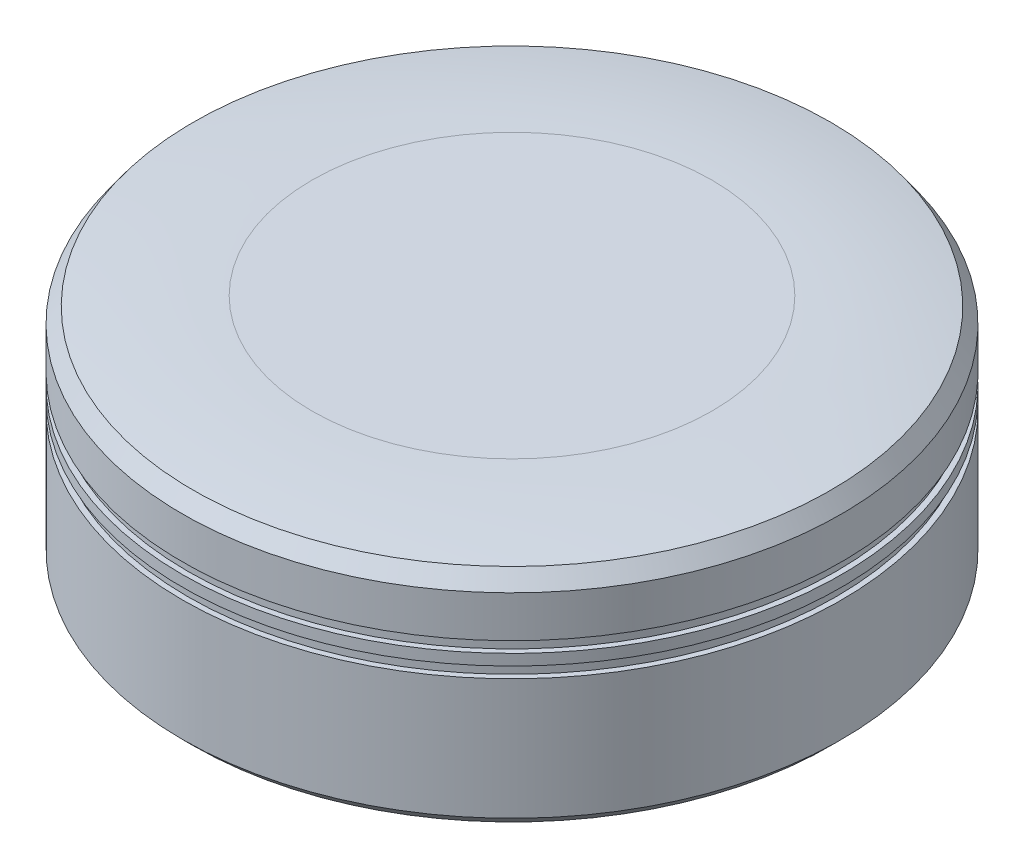
ISO-10303-21;
HEADER;
FILE_DESCRIPTION(('STEP AP214'),'2;1');
FILE_NAME('part.step','',(''),(''),'','','');
FILE_SCHEMA(('AUTOMOTIVE_DESIGN { 1 0 10303 214 1 1 1 1 }'));
ENDSEC;
DATA;
#1=APPLICATION_CONTEXT('core data for automotive mechanical design processes');
#2=APPLICATION_PROTOCOL_DEFINITION('international standard','automotive_design',2000,#1);
#3=PRODUCT_CONTEXT('',#1,'mechanical');
#4=PRODUCT('Part','Part','',(#3));
#5=PRODUCT_RELATED_PRODUCT_CATEGORY('part','',(#4));
#6=PRODUCT_DEFINITION_FORMATION('','',#4);
#7=PRODUCT_DEFINITION_CONTEXT('part definition',#1,'design');
#8=PRODUCT_DEFINITION('design','',#6,#7);
#9=PRODUCT_DEFINITION_SHAPE('','',#8);
#10=(LENGTH_UNIT() NAMED_UNIT(*) SI_UNIT(.MILLI.,.METRE.));
#11=(NAMED_UNIT(*) PLANE_ANGLE_UNIT() SI_UNIT($,.RADIAN.));
#12=(NAMED_UNIT(*) SI_UNIT($,.STERADIAN.) SOLID_ANGLE_UNIT());
#13=UNCERTAINTY_MEASURE_WITH_UNIT(LENGTH_MEASURE(1.E-05),#10,'distance_accuracy_value','');
#14=(GEOMETRIC_REPRESENTATION_CONTEXT(3) GLOBAL_UNCERTAINTY_ASSIGNED_CONTEXT((#13)) GLOBAL_UNIT_ASSIGNED_CONTEXT((#10,
#11,#12)) REPRESENTATION_CONTEXT('',''));
#15=CARTESIAN_POINT('',(0.,0.,0.));
#16=DIRECTION('',(0.,0.,1.));
#17=DIRECTION('',(1.,0.,0.));
#18=AXIS2_PLACEMENT_3D('',#15,#16,#17);
#19=CARTESIAN_POINT('',(0.,12.,0.));
#20=DIRECTION('',(0.,-1.,0.));
#21=DIRECTION('',(0.,0.,-1.));
#22=AXIS2_PLACEMENT_3D('',#19,#20,#21);
#23=CYLINDRICAL_SURFACE('',#22,15.);
#24=CARTESIAN_POINT('',(0.,8.5,0.));
#25=DIRECTION('',(0.,1.,0.));
#26=DIRECTION('',(0.,0.,1.));
#27=AXIS2_PLACEMENT_3D('',#24,#25,#26);
#28=CIRCLE('',#27,15.);
#29=CARTESIAN_POINT('',(0.,8.5,15.));
#30=VERTEX_POINT('',#29);
#31=EDGE_CURVE('E70',#30,#30,#28,.T.);
#32=ORIENTED_EDGE('',*,*,#31,.F.);
#33=EDGE_LOOP('',(#32));
#34=FACE_BOUND('',#33,.T.);
#35=CARTESIAN_POINT('',(0.,8.,0.));
#36=DIRECTION('',(0.,-1.,0.));
#37=DIRECTION('',(0.,0.,-1.));
#38=AXIS2_PLACEMENT_3D('',#35,#36,#37);
#39=CIRCLE('',#38,15.);
#40=CARTESIAN_POINT('',(0.,8.,-15.));
#41=VERTEX_POINT('',#40);
#42=EDGE_CURVE('E59',#41,#41,#39,.T.);
#43=ORIENTED_EDGE('',*,*,#42,.F.);
#44=EDGE_LOOP('',(#43));
#45=FACE_BOUND('',#44,.T.);
#46=ADVANCED_FACE('F35',(#34,#45),#23,.T.);
#47=CARTESIAN_POINT('',(14.75,9.,0.));
#48=DIRECTION('',(0.,-1.,0.));
#49=DIRECTION('',(0.,0.,-1.));
#50=AXIS2_PLACEMENT_3D('',#47,#48,#49);
#51=PLANE('',#50);
#52=CARTESIAN_POINT('',(0.,9.,0.));
#53=DIRECTION('',(0.,1.,0.));
#54=DIRECTION('',(0.,0.,1.));
#55=AXIS2_PLACEMENT_3D('',#52,#53,#54);
#56=CIRCLE('',#55,14.75);
#57=CARTESIAN_POINT('',(0.,9.,14.75));
#58=VERTEX_POINT('',#57);
#59=EDGE_CURVE('E73',#58,#58,#56,.T.);
#60=ORIENTED_EDGE('',*,*,#59,.T.);
#61=EDGE_LOOP('',(#60));
#62=FACE_BOUND('',#61,.T.);
#63=CARTESIAN_POINT('',(0.,9.,0.));
#64=DIRECTION('',(0.,-1.,0.));
#65=DIRECTION('',(0.,0.,-1.));
#66=AXIS2_PLACEMENT_3D('',#63,#64,#65);
#67=CIRCLE('',#66,15.);
#68=CARTESIAN_POINT('',(0.,9.,-15.));
#69=VERTEX_POINT('',#68);
#70=EDGE_CURVE('E67',#69,#69,#67,.T.);
#71=ORIENTED_EDGE('',*,*,#70,.T.);
#72=EDGE_LOOP('',(#71));
#73=FACE_BOUND('',#72,.T.);
#74=ADVANCED_FACE('F107',(#62,#73),#51,.T.);
#75=CARTESIAN_POINT('',(15.3281983976125,8.5,0.));
#76=DIRECTION('',(0.,1.,0.));
#77=DIRECTION('',(0.,0.,1.));
#78=AXIS2_PLACEMENT_3D('',#75,#76,#77);
#79=PLANE('',#78);
#80=CARTESIAN_POINT('',(0.,8.5,0.));
#81=DIRECTION('',(0.,1.,0.));
#82=DIRECTION('',(0.,0.,1.));
#83=AXIS2_PLACEMENT_3D('',#80,#81,#82);
#84=CIRCLE('',#83,14.75);
#85=CARTESIAN_POINT('',(0.,8.5,14.75));
#86=VERTEX_POINT('',#85);
#87=EDGE_CURVE('E62',#86,#86,#84,.T.);
#88=ORIENTED_EDGE('',*,*,#87,.F.);
#89=EDGE_LOOP('',(#88));
#90=FACE_BOUND('',#89,.T.);
#91=ORIENTED_EDGE('',*,*,#31,.T.);
#92=EDGE_LOOP('',(#91));
#93=FACE_BOUND('',#92,.T.);
#94=ADVANCED_FACE('F115',(#90,#93),#79,.T.);
#95=CARTESIAN_POINT('',(0.,13.0008010501509,0.));
#96=DIRECTION('',(0.,1.,0.));
#97=DIRECTION('',(0.,0.,1.));
#98=AXIS2_PLACEMENT_3D('',#95,#96,#97);
#99=CYLINDRICAL_SURFACE('',#98,14.75);
#100=ORIENTED_EDGE('',*,*,#87,.T.);
#101=EDGE_LOOP('',(#100));
#102=FACE_BOUND('',#101,.T.);
#103=ORIENTED_EDGE('',*,*,#59,.F.);
#104=EDGE_LOOP('',(#103));
#105=FACE_BOUND('',#104,.T.);
#106=ADVANCED_FACE('F135',(#102,#105),#99,.T.);
#107=CARTESIAN_POINT('',(0.,12.,0.));
#108=DIRECTION('',(0.,1.,0.));
#109=DIRECTION('',(0.,0.,1.));
#110=AXIS2_PLACEMENT_3D('',#107,#108,#109);
#111=PLANE('',#110);
#112=CARTESIAN_POINT('',(0.,12.,0.));
#113=DIRECTION('',(0.,1.,0.));
#114=DIRECTION('',(0.,0.,1.));
#115=AXIS2_PLACEMENT_3D('',#112,#113,#114);
#116=CIRCLE('',#115,9.1050869387242);
#117=CARTESIAN_POINT('',(0.,12.,9.1050869387242));
#118=VERTEX_POINT('',#117);
#119=EDGE_CURVE('E55',#118,#118,#116,.T.);
#120=ORIENTED_EDGE('',*,*,#119,.T.);
#121=EDGE_LOOP('',(#120));
#122=FACE_BOUND('',#121,.T.);
#123=ADVANCED_FACE('F126',(#122),#111,.T.);
#124=CARTESIAN_POINT('',(0.,10.8882207022308,0.));
#125=DIRECTION('',(0.,1.,0.));
#126=DIRECTION('',(0.,0.,1.));
#127=AXIS2_PLACEMENT_3D('',#124,#125,#126);
#128=CIRCLE('',#127,15.);
#129=CARTESIAN_POINT('',(0.,10.8882207022308,-15.));
#130=VERTEX_POINT('',#129);
#131=EDGE_CURVE('E50',#130,#130,#128,.F.);
#132=ORIENTED_EDGE('',*,*,#131,.T.);
#133=EDGE_LOOP('',(#132));
#134=FACE_BOUND('',#133,.T.);
#135=ORIENTED_EDGE('',*,*,#70,.F.);
#136=EDGE_LOOP('',(#135));
#137=FACE_BOUND('',#136,.T.);
#138=ADVANCED_FACE('F111',(#134,#137),#23,.T.);
#139=CARTESIAN_POINT('',(14.75,8.,0.));
#140=DIRECTION('',(0.,-1.,0.));
#141=DIRECTION('',(0.,0.,-1.));
#142=AXIS2_PLACEMENT_3D('',#139,#140,#141);
#143=PLANE('',#142);
#144=CARTESIAN_POINT('',(0.,8.,0.));
#145=DIRECTION('',(0.,1.,0.));
#146=DIRECTION('',(0.,0.,1.));
#147=AXIS2_PLACEMENT_3D('',#144,#145,#146);
#148=CIRCLE('',#147,14.75);
#149=CARTESIAN_POINT('',(0.,8.,14.75));
#150=VERTEX_POINT('',#149);
#151=EDGE_CURVE('E66',#150,#150,#148,.T.);
#152=ORIENTED_EDGE('',*,*,#151,.T.);
#153=EDGE_LOOP('',(#152));
#154=FACE_BOUND('',#153,.T.);
#155=ORIENTED_EDGE('',*,*,#42,.T.);
#156=EDGE_LOOP('',(#155));
#157=FACE_BOUND('',#156,.T.);
#158=ADVANCED_FACE('F125',(#154,#157),#143,.T.);
#159=CARTESIAN_POINT('',(15.3281983976125,7.5,0.));
#160=DIRECTION('',(0.,1.,0.));
#161=DIRECTION('',(0.,0.,1.));
#162=AXIS2_PLACEMENT_3D('',#159,#160,#161);
#163=PLANE('',#162);
#164=CARTESIAN_POINT('',(0.,7.5,0.));
#165=DIRECTION('',(0.,1.,0.));
#166=DIRECTION('',(0.,0.,1.));
#167=AXIS2_PLACEMENT_3D('',#164,#165,#166);
#168=CIRCLE('',#167,14.75);
#169=CARTESIAN_POINT('',(0.,7.5,14.75));
#170=VERTEX_POINT('',#169);
#171=EDGE_CURVE('E82',#170,#170,#168,.T.);
#172=ORIENTED_EDGE('',*,*,#171,.F.);
#173=EDGE_LOOP('',(#172));
#174=FACE_BOUND('',#173,.T.);
#175=CARTESIAN_POINT('',(0.,7.5,0.));
#176=DIRECTION('',(0.,1.,0.));
#177=DIRECTION('',(0.,0.,1.));
#178=AXIS2_PLACEMENT_3D('',#175,#176,#177);
#179=CIRCLE('',#178,15.);
#180=CARTESIAN_POINT('',(0.,7.5,15.));
#181=VERTEX_POINT('',#180);
#182=EDGE_CURVE('E63',#181,#181,#179,.T.);
#183=ORIENTED_EDGE('',*,*,#182,.T.);
#184=EDGE_LOOP('',(#183));
#185=FACE_BOUND('',#184,.T.);
#186=ADVANCED_FACE('F132',(#174,#185),#163,.T.);
#187=CARTESIAN_POINT('',(0.,13.0008010501509,0.));
#188=DIRECTION('',(0.,1.,0.));
#189=DIRECTION('',(0.,0.,1.));
#190=AXIS2_PLACEMENT_3D('',#187,#188,#189);
#191=CYLINDRICAL_SURFACE('',#190,14.75);
#192=ORIENTED_EDGE('',*,*,#171,.T.);
#193=EDGE_LOOP('',(#192));
#194=FACE_BOUND('',#193,.T.);
#195=ORIENTED_EDGE('',*,*,#151,.F.);
#196=EDGE_LOOP('',(#195));
#197=FACE_BOUND('',#196,.T.);
#198=ADVANCED_FACE('F123',(#194,#197),#191,.T.);
#199=CARTESIAN_POINT('',(0.,1.99999999999999,0.));
#200=DIRECTION('',(0.,1.,0.));
#201=DIRECTION('',(0.,0.,1.));
#202=AXIS2_PLACEMENT_3D('',#199,#200,#201);
#203=CIRCLE('',#202,15.);
#204=CARTESIAN_POINT('',(0.,1.99999999999999,15.));
#205=VERTEX_POINT('',#204);
#206=EDGE_CURVE('E42',#205,#205,#203,.T.);
#207=ORIENTED_EDGE('',*,*,#206,.T.);
#208=EDGE_LOOP('',(#207));
#209=FACE_BOUND('',#208,.T.);
#210=ORIENTED_EDGE('',*,*,#182,.F.);
#211=EDGE_LOOP('',(#210));
#212=FACE_BOUND('',#211,.T.);
#213=ADVANCED_FACE('F110',(#209,#212),#23,.T.);
#214=CARTESIAN_POINT('',(0.,-23.,0.));
#215=DIRECTION('',(0.,-1.,0.));
#216=DIRECTION('',(0.,0.,-1.));
#217=AXIS2_PLACEMENT_3D('',#214,#215,#216);
#218=DEGENERATE_TOROIDAL_SURFACE('',#217,9.1050869387242,35.,.T.);
#219=CARTESIAN_POINT('',(0.,11.5801487660169,0.));
#220=DIRECTION('',(0.,-1.,0.));
#221=DIRECTION('',(0.,0.,-1.));
#222=AXIS2_PLACEMENT_3D('',#219,#220,#221);
#223=CIRCLE('',#222,14.5100209179824);
#224=CARTESIAN_POINT('',(0.,11.5801487660169,-14.5100209179824));
#225=VERTEX_POINT('',#224);
#226=EDGE_CURVE('E46',#225,#225,#223,.F.);
#227=ORIENTED_EDGE('',*,*,#226,.T.);
#228=EDGE_LOOP('',(#227));
#229=FACE_BOUND('',#228,.T.);
#230=ORIENTED_EDGE('',*,*,#119,.F.);
#231=EDGE_LOOP('',(#230));
#232=FACE_BOUND('',#231,.T.);
#233=ADVANCED_FACE('F103',(#229,#232),#218,.T.);
#234=CARTESIAN_POINT('',(0.,10.8882207022308,0.));
#235=DIRECTION('',(0.,-1.,0.));
#236=DIRECTION('',(0.,0.,-1.));
#237=AXIS2_PLACEMENT_3D('',#234,#235,#236);
#238=CONICAL_SURFACE('',#237,15.,0.616165435683072);
#239=CARTESIAN_POINT('',(0.,11.5801487660169,-14.5100209179824));
#240=CARTESIAN_POINT('',(0.,11.5729411820191,-14.5151248667534));
#241=CARTESIAN_POINT('',(0.,11.5657335980214,-14.5202288155244));
#242=CARTESIAN_POINT('',(0.,11.5513184300258,-14.5304367130665));
#243=CARTESIAN_POINT('',(0.,11.544110846028,-14.5355406618375));
#244=CARTESIAN_POINT('',(0.,11.5296956780325,-14.5457485593795));
#245=CARTESIAN_POINT('',(0.,11.5224880940347,-14.5508525081505));
#246=CARTESIAN_POINT('',(0.,11.5080729260392,-14.5610604056926));
#247=CARTESIAN_POINT('',(0.,11.5008653420414,-14.5661643544636));
#248=CARTESIAN_POINT('',(0.,11.4864501740459,-14.5763722520056));
#249=CARTESIAN_POINT('',(0.,11.4792425900481,-14.5814762007766));
#250=CARTESIAN_POINT('',(0.,11.4648274220525,-14.5916840983187));
#251=CARTESIAN_POINT('',(0.,11.4576198380548,-14.5967880470897));
#252=CARTESIAN_POINT('',(0.,11.4432046700592,-14.6069959446317));
#253=CARTESIAN_POINT('',(0.,11.4359970860615,-14.6120998934027));
#254=CARTESIAN_POINT('',(0.,11.4215819180659,-14.6223077909448));
#255=CARTESIAN_POINT('',(0.,11.4143743340681,-14.6274117397158));
#256=CARTESIAN_POINT('',(0.,11.3999591660726,-14.6376196372578));
#257=CARTESIAN_POINT('',(0.,11.3927515820748,-14.6427235860288));
#258=CARTESIAN_POINT('',(0.,11.3783364140793,-14.6529314835709));
#259=CARTESIAN_POINT('',(0.,11.3711288300815,-14.6580354323419));
#260=CARTESIAN_POINT('',(0.,11.356713662086,-14.6682433298839));
#261=CARTESIAN_POINT('',(0.,11.3495060780882,-14.6733472786549));
#262=CARTESIAN_POINT('',(0.,11.3350909100926,-14.683555176197));
#263=CARTESIAN_POINT('',(0.,11.3278833260949,-14.688659124968));
#264=CARTESIAN_POINT('',(0.,11.3134681580993,-14.69886702251));
#265=CARTESIAN_POINT('',(0.,11.3062605741016,-14.703970971281));
#266=CARTESIAN_POINT('',(0.,11.291845406106,-14.7141788688231));
#267=CARTESIAN_POINT('',(0.,11.2846378221082,-14.7192828175941));
#268=CARTESIAN_POINT('',(0.,11.2702226541127,-14.7294907151361));
#269=CARTESIAN_POINT('',(0.,11.2630150701149,-14.7345946639071));
#270=CARTESIAN_POINT('',(0.,11.2485999021194,-14.7448025614492));
#271=CARTESIAN_POINT('',(0.,11.2413923181216,-14.7499065102202));
#272=CARTESIAN_POINT('',(0.,11.2269771501261,-14.7601144077622));
#273=CARTESIAN_POINT('',(0.,11.2197695661283,-14.7652183565332));
#274=CARTESIAN_POINT('',(0.,11.2053543981328,-14.7754262540753));
#275=CARTESIAN_POINT('',(0.,11.198146814135,-14.7805302028463));
#276=CARTESIAN_POINT('',(0.,11.1837316461394,-14.7907381003883));
#277=CARTESIAN_POINT('',(0.,11.1765240621417,-14.7958420491593));
#278=CARTESIAN_POINT('',(0.,11.1621088941461,-14.8060499467014));
#279=CARTESIAN_POINT('',(0.,11.1549013101483,-14.8111538954724));
#280=CARTESIAN_POINT('',(0.,11.1404861421528,-14.8213617930144));
#281=CARTESIAN_POINT('',(0.,11.133278558155,-14.8264657417854));
#282=CARTESIAN_POINT('',(0.,11.1188633901595,-14.8366736393275));
#283=CARTESIAN_POINT('',(0.,11.1116558061617,-14.8417775880985));
#284=CARTESIAN_POINT('',(0.,11.0972406381662,-14.8519854856405));
#285=CARTESIAN_POINT('',(0.,11.0900330541684,-14.8570894344115));
#286=CARTESIAN_POINT('',(0.,11.0756178861729,-14.8672973319536));
#287=CARTESIAN_POINT('',(0.,11.0684103021751,-14.8724012807246));
#288=CARTESIAN_POINT('',(0.,11.0539951341795,-14.8826091782666));
#289=CARTESIAN_POINT('',(0.,11.0467875501818,-14.8877131270376));
#290=CARTESIAN_POINT('',(0.,11.0323723821862,-14.8979210245797));
#291=CARTESIAN_POINT('',(0.,11.0251647981885,-14.9030249733507));
#292=CARTESIAN_POINT('',(0.,11.0107496301929,-14.9132328708927));
#293=CARTESIAN_POINT('',(0.,11.0035420461951,-14.9183368196637));
#294=CARTESIAN_POINT('',(0.,10.9891268781996,-14.9285447172058));
#295=CARTESIAN_POINT('',(0.,10.9819192942018,-14.9336486659768));
#296=CARTESIAN_POINT('',(0.,10.9675041262063,-14.9438565635188));
#297=CARTESIAN_POINT('',(0.,10.9602965422085,-14.9489605122898));
#298=CARTESIAN_POINT('',(0.,10.945881374213,-14.9591684098319));
#299=CARTESIAN_POINT('',(0.,10.9386737902152,-14.9642723586029));
#300=CARTESIAN_POINT('',(0.,10.9242586222196,-14.9744802561449));
#301=CARTESIAN_POINT('',(0.,10.9170510382219,-14.9795842049159));
#302=CARTESIAN_POINT('',(0.,10.9026358702263,-14.989792102458));
#303=CARTESIAN_POINT('',(0.,10.8954282862286,-14.994896051229));
#304=CARTESIAN_POINT('',(0.,10.8882207022308,-15.));
#305=B_SPLINE_CURVE_WITH_KNOTS('',3,(#239,#240,#241,#242,#243,#244,#245,#246,#247,#248,#249,
#250,#251,#252,#253,#254,#255,#256,#257,#258,#259,#260,#261,#262,#263,#264,#265,#266,#267,#268,
#269,#270,#271,#272,#273,#274,#275,#276,#277,#278,#279,#280,#281,#282,#283,#284,#285,#286,#287,
#288,#289,#290,#291,#292,#293,#294,#295,#296,#297,#298,#299,#300,#301,#302,#303,#304),
.UNSPECIFIED.,.F.,.F.,(4,2,2,2,2,2,2,2,2,2,2,2,2,2,2,2,2,2,2,2,2,2,2,2,2,2,2,2,2,2,2,2,4),(0.,
0.0264952078927305,0.0529904157854586,0.0794856236781867,0.105980831570917,0.132476039463645,
0.158971247356374,0.185466455249103,0.211961663141832,0.238456871034561,0.264952078927289,
0.291447286820019,0.317942494712748,0.344437702605476,0.370932910498205,0.397428118390935,
0.423923326283663,0.450418534176392,0.476913742069121,0.503408949961849,0.529904157854579,
0.556399365747307,0.582894573640037,0.609389781532765,0.635884989425493,0.662380197318224,
0.688875405210952,0.71537061310368,0.741865820996409,0.768361028889139,0.794856236781868,
0.821351444674596,0.847846652567324),.UNSPECIFIED.);
#306=EDGE_CURVE('BSEAM95',#225,#130,#305,.T.);
#307=ORIENTED_EDGE('',*,*,#226,.F.);
#308=ORIENTED_EDGE('',*,*,#131,.F.);
#309=ORIENTED_EDGE('',*,*,#306,.T.);
#310=ORIENTED_EDGE('',*,*,#306,.F.);
#311=EDGE_LOOP('',(#307,#309,#308,#310));
#312=FACE_BOUND('',#311,.T.);
#313=ADVANCED_FACE('F95',(#312),#238,.T.);
#314=CARTESIAN_POINT('',(-15.,1.5,-15.));
#315=DIRECTION('',(0.,1.,0.));
#316=DIRECTION('',(0.,0.,1.));
#317=AXIS2_PLACEMENT_3D('',#314,#315,#316);
#318=PLANE('',#317);
#319=CARTESIAN_POINT('',(0.,1.5,0.));
#320=DIRECTION('',(0.,1.,0.));
#321=DIRECTION('',(0.,0.,1.));
#322=AXIS2_PLACEMENT_3D('',#319,#320,#321);
#323=CIRCLE('',#322,14.5);
#324=CARTESIAN_POINT('',(0.,1.5,14.5));
#325=VERTEX_POINT('',#324);
#326=EDGE_CURVE('E10',#325,#325,#323,.F.);
#327=ORIENTED_EDGE('',*,*,#326,.T.);
#328=EDGE_LOOP('',(#327));
#329=FACE_BOUND('',#328,.T.);
#330=CARTESIAN_POINT('',(0.,1.5,0.));
#331=DIRECTION('',(0.,1.,0.));
#332=DIRECTION('',(0.,0.,1.));
#333=AXIS2_PLACEMENT_3D('',#330,#331,#332);
#334=CIRCLE('',#333,2.95);
#335=CARTESIAN_POINT('',(0.,1.5,2.95));
#336=VERTEX_POINT('',#335);
#337=EDGE_CURVE('E85',#336,#336,#334,.F.);
#338=ORIENTED_EDGE('',*,*,#337,.F.);
#339=EDGE_LOOP('',(#338));
#340=FACE_BOUND('',#339,.T.);
#341=ADVANCED_FACE('F92',(#329,#340),#318,.F.);
#342=CARTESIAN_POINT('',(0.,9.8,0.));
#343=DIRECTION('',(0.,-1.,0.));
#344=DIRECTION('',(0.,0.,-1.));
#345=AXIS2_PLACEMENT_3D('',#342,#343,#344);
#346=PLANE('',#345);
#347=CARTESIAN_POINT('',(0.,9.8,0.));
#348=DIRECTION('',(0.,-1.,0.));
#349=DIRECTION('',(0.,0.,-1.));
#350=AXIS2_PLACEMENT_3D('',#347,#348,#349);
#351=CIRCLE('',#350,2.95);
#352=CARTESIAN_POINT('',(0.,9.8,-2.95));
#353=VERTEX_POINT('',#352);
#354=EDGE_CURVE('E58',#353,#353,#351,.T.);
#355=ORIENTED_EDGE('',*,*,#354,.T.);
#356=EDGE_LOOP('',(#355));
#357=FACE_BOUND('',#356,.T.);
#358=ADVANCED_FACE('F94',(#357),#346,.T.);
#359=CARTESIAN_POINT('',(0.,9.8,0.));
#360=DIRECTION('',(0.,-1.,0.));
#361=DIRECTION('',(0.,0.,-1.));
#362=AXIS2_PLACEMENT_3D('',#359,#360,#361);
#363=CYLINDRICAL_SURFACE('',#362,2.95);
#364=ORIENTED_EDGE('',*,*,#337,.T.);
#365=EDGE_LOOP('',(#364));
#366=FACE_BOUND('',#365,.T.);
#367=ORIENTED_EDGE('',*,*,#354,.F.);
#368=EDGE_LOOP('',(#367));
#369=FACE_BOUND('',#368,.T.);
#370=ADVANCED_FACE('F89',(#366,#369),#363,.F.);
#371=CARTESIAN_POINT('',(0.,1.99999999999999,0.));
#372=DIRECTION('',(0.,1.,0.));
#373=DIRECTION('',(0.,0.,1.));
#374=AXIS2_PLACEMENT_3D('',#371,#372,#373);
#375=CONICAL_SURFACE('',#374,15.,0.785398163397452);
#376=ORIENTED_EDGE('',*,*,#326,.F.);
#377=EDGE_LOOP('',(#376));
#378=FACE_BOUND('',#377,.T.);
#379=ORIENTED_EDGE('',*,*,#206,.F.);
#380=EDGE_LOOP('',(#379));
#381=FACE_BOUND('',#380,.T.);
#382=ADVANCED_FACE('F37',(#378,#381),#375,.T.);
#383=CLOSED_SHELL('',(#46,#74,#94,#106,#123,#138,#158,#186,#198,#213,#233,#313,#341,#358,#370,#382));
#384=MANIFOLD_SOLID_BREP('B2',#383);
#385=ADVANCED_BREP_SHAPE_REPRESENTATION('',(#18,#384),#14);
#386=SHAPE_DEFINITION_REPRESENTATION(#9,#385);
ENDSEC;
END-ISO-10303-21;
